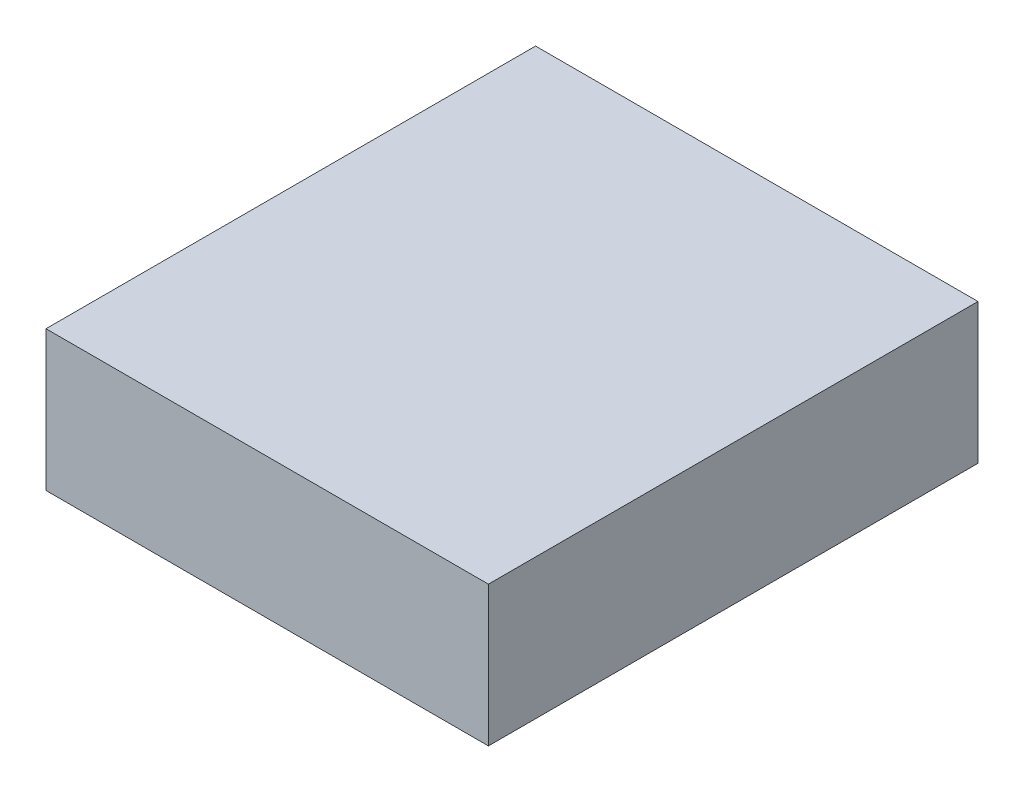
ISO-10303-21;
HEADER;
FILE_DESCRIPTION(('STEP AP214'),'2;1');
FILE_NAME('part.step','',(''),(''),'','','');
FILE_SCHEMA(('AUTOMOTIVE_DESIGN { 1 0 10303 214 1 1 1 1 }'));
ENDSEC;
DATA;
#1=APPLICATION_CONTEXT('core data for automotive mechanical design processes');
#2=APPLICATION_PROTOCOL_DEFINITION('international standard','automotive_design',2000,#1);
#3=PRODUCT_CONTEXT('',#1,'mechanical');
#4=PRODUCT('Part','Part','',(#3));
#5=PRODUCT_RELATED_PRODUCT_CATEGORY('part','',(#4));
#6=PRODUCT_DEFINITION_FORMATION('','',#4);
#7=PRODUCT_DEFINITION_CONTEXT('part definition',#1,'design');
#8=PRODUCT_DEFINITION('design','',#6,#7);
#9=PRODUCT_DEFINITION_SHAPE('','',#8);
#10=(LENGTH_UNIT() NAMED_UNIT(*) SI_UNIT(.MILLI.,.METRE.));
#11=(NAMED_UNIT(*) PLANE_ANGLE_UNIT() SI_UNIT($,.RADIAN.));
#12=(NAMED_UNIT(*) SI_UNIT($,.STERADIAN.) SOLID_ANGLE_UNIT());
#13=UNCERTAINTY_MEASURE_WITH_UNIT(LENGTH_MEASURE(1.E-05),#10,'distance_accuracy_value','');
#14=(GEOMETRIC_REPRESENTATION_CONTEXT(3) GLOBAL_UNCERTAINTY_ASSIGNED_CONTEXT((#13)) GLOBAL_UNIT_ASSIGNED_CONTEXT((#10,
#11,#12)) REPRESENTATION_CONTEXT('',''));
#15=CARTESIAN_POINT('',(0.,0.,0.));
#16=DIRECTION('',(0.,0.,1.));
#17=DIRECTION('',(1.,0.,0.));
#18=AXIS2_PLACEMENT_3D('',#15,#16,#17);
#19=CARTESIAN_POINT('',(110.509484608928,80.,122.290495949038));
#20=DIRECTION('',(1.,0.,0.));
#21=DIRECTION('',(0.,0.,-1.));
#22=AXIS2_PLACEMENT_3D('',#19,#20,#21);
#23=PLANE('',#22);
#24=DIRECTION('',(0.,0.,1.));
#25=VECTOR('',#24,1.);
#26=CARTESIAN_POINT('',(110.509484608928,9.99999999999998,122.290495949038));
#27=LINE('',#26,#25);
#28=CARTESIAN_POINT('',(110.509484608928,9.99999999999999,-122.290495949038));
#29=VERTEX_POINT('',#28);
#30=CARTESIAN_POINT('',(110.509484608928,9.99999999999998,122.290495949038));
#31=VERTEX_POINT('',#30);
#32=EDGE_CURVE('E82',#29,#31,#27,.T.);
#33=ORIENTED_EDGE('',*,*,#32,.F.);
#34=DIRECTION('',(0.,-1.,0.));
#35=VECTOR('',#34,1.);
#36=CARTESIAN_POINT('',(110.509484608928,80.,-122.290495949038));
#37=LINE('',#36,#35);
#38=CARTESIAN_POINT('',(110.509484608928,80.,-122.290495949038));
#39=VERTEX_POINT('',#38);
#40=EDGE_CURVE('E101',#39,#29,#37,.T.);
#41=ORIENTED_EDGE('',*,*,#40,.F.);
#42=DIRECTION('',(0.,0.,1.));
#43=VECTOR('',#42,1.);
#44=CARTESIAN_POINT('',(110.509484608928,80.,122.290495949038));
#45=LINE('',#44,#43);
#46=CARTESIAN_POINT('',(110.509484608928,80.,122.290495949038));
#47=VERTEX_POINT('',#46);
#48=EDGE_CURVE('E85',#39,#47,#45,.T.);
#49=ORIENTED_EDGE('',*,*,#48,.T.);
#50=DIRECTION('',(0.,-1.,0.));
#51=VECTOR('',#50,1.);
#52=CARTESIAN_POINT('',(110.509484608928,80.,122.290495949038));
#53=LINE('',#52,#51);
#54=EDGE_CURVE('E62',#47,#31,#53,.T.);
#55=ORIENTED_EDGE('',*,*,#54,.T.);
#56=EDGE_LOOP('',(#33,#41,#49,#55));
#57=FACE_BOUND('',#56,.T.);
#58=ADVANCED_FACE('F39',(#57),#23,.T.);
#59=CARTESIAN_POINT('',(-110.509484608928,80.,-122.290495949038));
#60=DIRECTION('',(0.,0.,-1.));
#61=DIRECTION('',(-1.,0.,0.));
#62=AXIS2_PLACEMENT_3D('',#59,#60,#61);
#63=PLANE('',#62);
#64=DIRECTION('',(1.,0.,0.));
#65=VECTOR('',#64,1.);
#66=CARTESIAN_POINT('',(-110.509484608928,9.99999999999999,-122.290495949038));
#67=LINE('',#66,#65);
#68=CARTESIAN_POINT('',(-110.509484608928,9.99999999999999,-122.290495949038));
#69=VERTEX_POINT('',#68);
#70=EDGE_CURVE('E93',#69,#29,#67,.T.);
#71=ORIENTED_EDGE('',*,*,#70,.F.);
#72=DIRECTION('',(0.,-1.,0.));
#73=VECTOR('',#72,1.);
#74=CARTESIAN_POINT('',(-110.509484608928,80.,-122.290495949038));
#75=LINE('',#74,#73);
#76=CARTESIAN_POINT('',(-110.509484608928,80.,-122.290495949038));
#77=VERTEX_POINT('',#76);
#78=EDGE_CURVE('E104',#77,#69,#75,.T.);
#79=ORIENTED_EDGE('',*,*,#78,.F.);
#80=DIRECTION('',(1.,0.,0.));
#81=VECTOR('',#80,1.);
#82=CARTESIAN_POINT('',(-110.509484608928,80.,-122.290495949038));
#83=LINE('',#82,#81);
#84=EDGE_CURVE('E86',#77,#39,#83,.T.);
#85=ORIENTED_EDGE('',*,*,#84,.T.);
#86=ORIENTED_EDGE('',*,*,#40,.T.);
#87=EDGE_LOOP('',(#71,#79,#85,#86));
#88=FACE_BOUND('',#87,.T.);
#89=ADVANCED_FACE('F177',(#88),#63,.T.);
#90=CARTESIAN_POINT('',(-110.509484608928,80.,122.290495949038));
#91=DIRECTION('',(-1.,0.,0.));
#92=DIRECTION('',(0.,0.,1.));
#93=AXIS2_PLACEMENT_3D('',#90,#91,#92);
#94=PLANE('',#93);
#95=DIRECTION('',(0.,0.,-1.));
#96=VECTOR('',#95,1.);
#97=CARTESIAN_POINT('',(-110.509484608928,9.99999999999998,122.290495949038));
#98=LINE('',#97,#96);
#99=CARTESIAN_POINT('',(-110.509484608928,9.99999999999998,122.290495949038));
#100=VERTEX_POINT('',#99);
#101=EDGE_CURVE('E11',#100,#69,#98,.T.);
#102=ORIENTED_EDGE('',*,*,#101,.F.);
#103=DIRECTION('',(0.,-1.,0.));
#104=VECTOR('',#103,1.);
#105=CARTESIAN_POINT('',(-110.509484608928,80.,122.290495949038));
#106=LINE('',#105,#104);
#107=CARTESIAN_POINT('',(-110.509484608928,80.,122.290495949038));
#108=VERTEX_POINT('',#107);
#109=EDGE_CURVE('E57',#108,#100,#106,.T.);
#110=ORIENTED_EDGE('',*,*,#109,.F.);
#111=DIRECTION('',(0.,0.,-1.));
#112=VECTOR('',#111,1.);
#113=CARTESIAN_POINT('',(-110.509484608928,80.,122.290495949038));
#114=LINE('',#113,#112);
#115=EDGE_CURVE('E103',#108,#77,#114,.T.);
#116=ORIENTED_EDGE('',*,*,#115,.T.);
#117=ORIENTED_EDGE('',*,*,#78,.T.);
#118=EDGE_LOOP('',(#102,#110,#116,#117));
#119=FACE_BOUND('',#118,.T.);
#120=ADVANCED_FACE('F182',(#119),#94,.T.);
#121=CARTESIAN_POINT('',(-110.509484608928,80.,122.290495949038));
#122=DIRECTION('',(0.,0.,1.));
#123=DIRECTION('',(1.,0.,0.));
#124=AXIS2_PLACEMENT_3D('',#121,#122,#123);
#125=PLANE('',#124);
#126=DIRECTION('',(-1.,0.,0.));
#127=VECTOR('',#126,1.);
#128=CARTESIAN_POINT('',(-110.509484608928,9.99999999999998,122.290495949038));
#129=LINE('',#128,#127);
#130=EDGE_CURVE('E49',#31,#100,#129,.T.);
#131=ORIENTED_EDGE('',*,*,#130,.F.);
#132=ORIENTED_EDGE('',*,*,#54,.F.);
#133=DIRECTION('',(-1.,0.,0.));
#134=VECTOR('',#133,1.);
#135=CARTESIAN_POINT('',(-110.509484608928,80.,122.290495949038));
#136=LINE('',#135,#134);
#137=EDGE_CURVE('E107',#47,#108,#136,.T.);
#138=ORIENTED_EDGE('',*,*,#137,.T.);
#139=ORIENTED_EDGE('',*,*,#109,.T.);
#140=EDGE_LOOP('',(#131,#132,#138,#139));
#141=FACE_BOUND('',#140,.T.);
#142=ADVANCED_FACE('F88',(#141),#125,.T.);
#143=CARTESIAN_POINT('',(0.,80.,0.));
#144=DIRECTION('',(0.,-1.,0.));
#145=DIRECTION('',(0.,0.,-1.));
#146=AXIS2_PLACEMENT_3D('',#143,#144,#145);
#147=PLANE('',#146);
#148=ORIENTED_EDGE('',*,*,#48,.F.);
#149=ORIENTED_EDGE('',*,*,#84,.F.);
#150=ORIENTED_EDGE('',*,*,#115,.F.);
#151=ORIENTED_EDGE('',*,*,#137,.F.);
#152=EDGE_LOOP('',(#148,#149,#150,#151));
#153=FACE_BOUND('',#152,.T.);
#154=ADVANCED_FACE('F188',(#153),#147,.F.);
#155=CARTESIAN_POINT('',(0.,0.,0.));
#156=DIRECTION('',(0.,-1.,0.));
#157=DIRECTION('',(0.,0.,-1.));
#158=AXIS2_PLACEMENT_3D('',#155,#156,#157);
#159=PLANE('',#158);
#160=CARTESIAN_POINT('',(-20.,0.,20.0000000000041));
#161=DIRECTION('',(0.,-1.,0.));
#162=DIRECTION('',(0.,0.,-1.));
#163=AXIS2_PLACEMENT_3D('',#160,#161,#162);
#164=CIRCLE('',#163,9.65089870143983);
#165=CARTESIAN_POINT('',(-20.,0.,10.3491012985643));
#166=VERTEX_POINT('',#165);
#167=EDGE_CURVE('E98',#166,#166,#164,.T.);
#168=ORIENTED_EDGE('',*,*,#167,.T.);
#169=EDGE_LOOP('',(#168));
#170=FACE_BOUND('',#169,.T.);
#171=ADVANCED_FACE('F155',(#170),#159,.T.);
#172=CARTESIAN_POINT('',(-20.,20.,-20.));
#173=DIRECTION('',(0.,1.,0.));
#174=DIRECTION('',(0.,0.,1.));
#175=AXIS2_PLACEMENT_3D('',#172,#173,#174);
#176=CONICAL_SURFACE('',#175,10.,0.0174532925199433);
#177=CARTESIAN_POINT('',(-20.,0.,-20.));
#178=DIRECTION('',(0.,-1.,0.));
#179=DIRECTION('',(0.,0.,-1.));
#180=AXIS2_PLACEMENT_3D('',#177,#178,#179);
#181=CIRCLE('',#180,9.65089870143565);
#182=CARTESIAN_POINT('',(-20.,0.,-29.6508987014357));
#183=VERTEX_POINT('',#182);
#184=EDGE_CURVE('E120',#183,#183,#181,.T.);
#185=ORIENTED_EDGE('',*,*,#184,.F.);
#186=EDGE_LOOP('',(#185));
#187=FACE_BOUND('',#186,.T.);
#188=CARTESIAN_POINT('',(-20.,20.,-20.));
#189=DIRECTION('',(0.,1.,0.));
#190=DIRECTION('',(0.,0.,1.));
#191=AXIS2_PLACEMENT_3D('',#188,#189,#190);
#192=CIRCLE('',#191,10.);
#193=CARTESIAN_POINT('',(-20.,20.,-10.));
#194=VERTEX_POINT('',#193);
#195=EDGE_CURVE('E124',#194,#194,#192,.T.);
#196=ORIENTED_EDGE('',*,*,#195,.F.);
#197=EDGE_LOOP('',(#196));
#198=FACE_BOUND('',#197,.T.);
#199=ADVANCED_FACE('F151',(#187,#198),#176,.T.);
#200=CARTESIAN_POINT('',(20.0000000000041,20.,-20.));
#201=DIRECTION('',(0.,1.,0.));
#202=DIRECTION('',(0.,0.,1.));
#203=AXIS2_PLACEMENT_3D('',#200,#201,#202);
#204=CONICAL_SURFACE('',#203,9.99999999999888,0.0174532925199433);
#205=CARTESIAN_POINT('',(20.0000000000041,0.,-20.));
#206=DIRECTION('',(0.,-1.,0.));
#207=DIRECTION('',(0.,0.,-1.));
#208=AXIS2_PLACEMENT_3D('',#205,#206,#207);
#209=CIRCLE('',#208,9.65089870143453);
#210=CARTESIAN_POINT('',(20.0000000000041,0.,-29.6508987014345));
#211=VERTEX_POINT('',#210);
#212=EDGE_CURVE('E134',#211,#211,#209,.T.);
#213=ORIENTED_EDGE('',*,*,#212,.F.);
#214=EDGE_LOOP('',(#213));
#215=FACE_BOUND('',#214,.T.);
#216=CARTESIAN_POINT('',(20.0000000000041,20.,-20.));
#217=DIRECTION('',(0.,1.,0.));
#218=DIRECTION('',(0.,0.,1.));
#219=AXIS2_PLACEMENT_3D('',#216,#217,#218);
#220=CIRCLE('',#219,9.99999999999888);
#221=CARTESIAN_POINT('',(20.0000000000041,20.,-10.0000000000011));
#222=VERTEX_POINT('',#221);
#223=EDGE_CURVE('E130',#222,#222,#220,.T.);
#224=ORIENTED_EDGE('',*,*,#223,.F.);
#225=EDGE_LOOP('',(#224));
#226=FACE_BOUND('',#225,.T.);
#227=ADVANCED_FACE('F154',(#215,#226),#204,.T.);
#228=CARTESIAN_POINT('',(20.0000000000041,20.,20.0000000000041));
#229=DIRECTION('',(0.,1.,0.));
#230=DIRECTION('',(0.,0.,1.));
#231=AXIS2_PLACEMENT_3D('',#228,#229,#230);
#232=CONICAL_SURFACE('',#231,10.0000000000029,0.0174532925199433);
#233=CARTESIAN_POINT('',(20.0000000000041,0.,20.0000000000041));
#234=DIRECTION('',(0.,-1.,0.));
#235=DIRECTION('',(0.,0.,-1.));
#236=AXIS2_PLACEMENT_3D('',#233,#234,#235);
#237=CIRCLE('',#236,9.65089870143854);
#238=CARTESIAN_POINT('',(20.0000000000041,0.,10.3491012985656));
#239=VERTEX_POINT('',#238);
#240=EDGE_CURVE('E95',#239,#239,#237,.T.);
#241=ORIENTED_EDGE('',*,*,#240,.F.);
#242=EDGE_LOOP('',(#241));
#243=FACE_BOUND('',#242,.T.);
#244=CARTESIAN_POINT('',(20.0000000000041,20.,20.0000000000041));
#245=DIRECTION('',(0.,1.,0.));
#246=DIRECTION('',(0.,0.,1.));
#247=AXIS2_PLACEMENT_3D('',#244,#245,#246);
#248=CIRCLE('',#247,10.0000000000029);
#249=CARTESIAN_POINT('',(20.0000000000041,20.,30.000000000007));
#250=VERTEX_POINT('',#249);
#251=EDGE_CURVE('E127',#250,#250,#248,.T.);
#252=ORIENTED_EDGE('',*,*,#251,.F.);
#253=EDGE_LOOP('',(#252));
#254=FACE_BOUND('',#253,.T.);
#255=ADVANCED_FACE('F193',(#243,#254),#232,.T.);
#256=CARTESIAN_POINT('',(-20.,20.,20.0000000000041));
#257=DIRECTION('',(0.,1.,0.));
#258=DIRECTION('',(0.,0.,1.));
#259=AXIS2_PLACEMENT_3D('',#256,#257,#258);
#260=CONICAL_SURFACE('',#259,10.0000000000042,0.0174532925199433);
#261=ORIENTED_EDGE('',*,*,#167,.F.);
#262=EDGE_LOOP('',(#261));
#263=FACE_BOUND('',#262,.T.);
#264=CARTESIAN_POINT('',(-20.,20.,20.0000000000041));
#265=DIRECTION('',(0.,1.,0.));
#266=DIRECTION('',(0.,0.,1.));
#267=AXIS2_PLACEMENT_3D('',#264,#265,#266);
#268=CIRCLE('',#267,10.0000000000042);
#269=CARTESIAN_POINT('',(-20.,20.,30.0000000000083));
#270=VERTEX_POINT('',#269);
#271=EDGE_CURVE('E110',#270,#270,#268,.T.);
#272=ORIENTED_EDGE('',*,*,#271,.F.);
#273=EDGE_LOOP('',(#272));
#274=FACE_BOUND('',#273,.T.);
#275=ADVANCED_FACE('F163',(#263,#274),#260,.T.);
#276=CARTESIAN_POINT('',(0.,20.,0.));
#277=DIRECTION('',(0.,-1.,0.));
#278=DIRECTION('',(0.,0.,-1.));
#279=AXIS2_PLACEMENT_3D('',#276,#277,#278);
#280=PLANE('',#279);
#281=ORIENTED_EDGE('',*,*,#271,.T.);
#282=EDGE_LOOP('',(#281));
#283=FACE_BOUND('',#282,.T.);
#284=ORIENTED_EDGE('',*,*,#251,.T.);
#285=EDGE_LOOP('',(#284));
#286=FACE_BOUND('',#285,.T.);
#287=ORIENTED_EDGE('',*,*,#223,.T.);
#288=EDGE_LOOP('',(#287));
#289=FACE_BOUND('',#288,.T.);
#290=ORIENTED_EDGE('',*,*,#195,.T.);
#291=EDGE_LOOP('',(#290));
#292=FACE_BOUND('',#291,.T.);
#293=CARTESIAN_POINT('',(0.,20.,0.));
#294=DIRECTION('',(0.,-1.,0.));
#295=DIRECTION('',(0.,0.,-1.));
#296=AXIS2_PLACEMENT_3D('',#293,#294,#295);
#297=CIRCLE('',#296,50.);
#298=CARTESIAN_POINT('',(0.,20.,-50.));
#299=VERTEX_POINT('',#298);
#300=EDGE_CURVE('E121',#299,#299,#297,.T.);
#301=ORIENTED_EDGE('',*,*,#300,.T.);
#302=EDGE_LOOP('',(#301));
#303=FACE_BOUND('',#302,.T.);
#304=ADVANCED_FACE('F159',(#283,#286,#289,#292,#303),#280,.T.);
#305=CARTESIAN_POINT('',(0.,10.,0.));
#306=DIRECTION('',(0.,-1.,0.));
#307=DIRECTION('',(0.,0.,-1.));
#308=AXIS2_PLACEMENT_3D('',#305,#306,#307);
#309=TOROIDAL_SURFACE('',#308,61.180339887499,15.);
#310=CARTESIAN_POINT('',(0.,10.,0.));
#311=DIRECTION('',(0.,-1.,0.));
#312=DIRECTION('',(0.,0.,-1.));
#313=AXIS2_PLACEMENT_3D('',#310,#311,#312);
#314=CIRCLE('',#313,76.1803398874989);
#315=CARTESIAN_POINT('',(0.,10.,-76.1803398874989));
#316=VERTEX_POINT('',#315);
#317=EDGE_CURVE('E116',#316,#316,#314,.T.);
#318=ORIENTED_EDGE('',*,*,#317,.T.);
#319=EDGE_LOOP('',(#318));
#320=FACE_BOUND('',#319,.T.);
#321=ORIENTED_EDGE('',*,*,#300,.F.);
#322=EDGE_LOOP('',(#321));
#323=FACE_BOUND('',#322,.T.);
#324=ADVANCED_FACE('F162',(#320,#323),#309,.F.);
#325=CARTESIAN_POINT('',(0.,0.,0.));
#326=DIRECTION('',(0.,-1.,0.));
#327=DIRECTION('',(0.,0.,-1.));
#328=AXIS2_PLACEMENT_3D('',#325,#326,#327);
#329=PLANE('',#328);
#330=ORIENTED_EDGE('',*,*,#184,.T.);
#331=EDGE_LOOP('',(#330));
#332=FACE_BOUND('',#331,.T.);
#333=ADVANCED_FACE('F149',(#332),#329,.T.);
#334=CARTESIAN_POINT('',(0.,0.,0.));
#335=DIRECTION('',(0.,-1.,0.));
#336=DIRECTION('',(0.,0.,-1.));
#337=AXIS2_PLACEMENT_3D('',#334,#335,#336);
#338=PLANE('',#337);
#339=ORIENTED_EDGE('',*,*,#212,.T.);
#340=EDGE_LOOP('',(#339));
#341=FACE_BOUND('',#340,.T.);
#342=ADVANCED_FACE('F174',(#341),#338,.T.);
#343=CARTESIAN_POINT('',(0.,0.,0.));
#344=DIRECTION('',(0.,-1.,0.));
#345=DIRECTION('',(0.,0.,-1.));
#346=AXIS2_PLACEMENT_3D('',#343,#344,#345);
#347=PLANE('',#346);
#348=ORIENTED_EDGE('',*,*,#240,.T.);
#349=EDGE_LOOP('',(#348));
#350=FACE_BOUND('',#349,.T.);
#351=ADVANCED_FACE('F242',(#350),#347,.T.);
#352=CARTESIAN_POINT('',(-1.59378207120077,10.,-76.1803403189587));
#353=DIRECTION('',(0.,1.,0.));
#354=DIRECTION('',(0.999999999999963,0.,2.70714461886545E-07));
#355=AXIS2_PLACEMENT_3D('',#352,#353,#354);
#356=PLANE('',#355);
#357=ORIENTED_EDGE('',*,*,#70,.T.);
#358=ORIENTED_EDGE('',*,*,#32,.T.);
#359=ORIENTED_EDGE('',*,*,#130,.T.);
#360=ORIENTED_EDGE('',*,*,#101,.T.);
#361=EDGE_LOOP('',(#357,#358,#359,#360));
#362=FACE_BOUND('',#361,.T.);
#363=ORIENTED_EDGE('',*,*,#317,.F.);
#364=EDGE_LOOP('',(#363));
#365=FACE_BOUND('',#364,.T.);
#366=ADVANCED_FACE('F41',(#362,#365),#356,.F.);
#367=CLOSED_SHELL('',(#58,#89,#120,#142,#154,#171,#199,#227,#255,#275,#304,#324,#333,#342,#351,#366));
#368=MANIFOLD_SOLID_BREP('B2',#367);
#369=ADVANCED_BREP_SHAPE_REPRESENTATION('',(#18,#368),#14);
#370=SHAPE_DEFINITION_REPRESENTATION(#9,#369);
ENDSEC;
END-ISO-10303-21;
